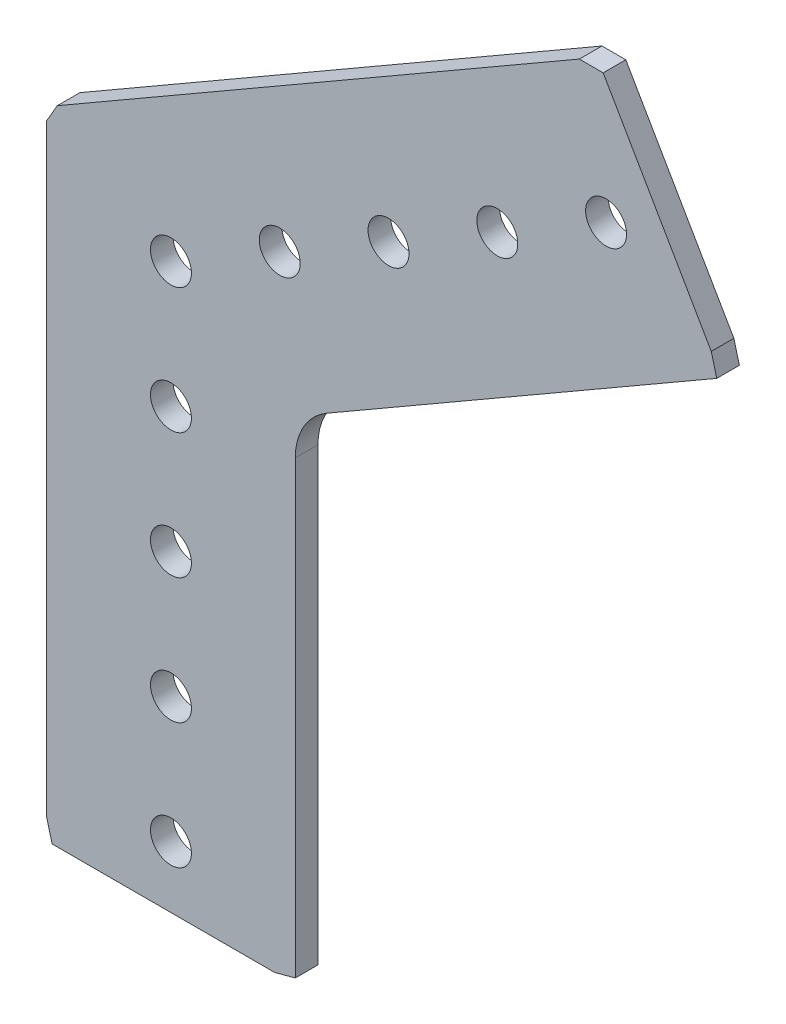
ISO-10303-21;
HEADER;
FILE_DESCRIPTION(('STEP AP214'),'2;1');
FILE_NAME('part.step','',(''),(''),'','','');
FILE_SCHEMA(('AUTOMOTIVE_DESIGN { 1 0 10303 214 1 1 1 1 }'));
ENDSEC;
DATA;
#1=APPLICATION_CONTEXT('core data for automotive mechanical design processes');
#2=APPLICATION_PROTOCOL_DEFINITION('international standard','automotive_design',2000,#1);
#3=PRODUCT_CONTEXT('',#1,'mechanical');
#4=PRODUCT('Part','Part','',(#3));
#5=PRODUCT_RELATED_PRODUCT_CATEGORY('part','',(#4));
#6=PRODUCT_DEFINITION_FORMATION('','',#4);
#7=PRODUCT_DEFINITION_CONTEXT('part definition',#1,'design');
#8=PRODUCT_DEFINITION('design','',#6,#7);
#9=PRODUCT_DEFINITION_SHAPE('','',#8);
#10=(LENGTH_UNIT() NAMED_UNIT(*) SI_UNIT(.MILLI.,.METRE.));
#11=(NAMED_UNIT(*) PLANE_ANGLE_UNIT() SI_UNIT($,.RADIAN.));
#12=(NAMED_UNIT(*) SI_UNIT($,.STERADIAN.) SOLID_ANGLE_UNIT());
#13=UNCERTAINTY_MEASURE_WITH_UNIT(LENGTH_MEASURE(1.E-05),#10,'distance_accuracy_value','');
#14=(GEOMETRIC_REPRESENTATION_CONTEXT(3) GLOBAL_UNCERTAINTY_ASSIGNED_CONTEXT((#13)) GLOBAL_UNIT_ASSIGNED_CONTEXT((#10,
#11,#12)) REPRESENTATION_CONTEXT('',''));
#15=CARTESIAN_POINT('',(0.,0.,0.));
#16=DIRECTION('',(0.,0.,1.));
#17=DIRECTION('',(1.,0.,0.));
#18=AXIS2_PLACEMENT_3D('',#15,#16,#17);
#19=CARTESIAN_POINT('',(0.,0.,2.286));
#20=DIRECTION('',(0.,0.,1.));
#21=DIRECTION('',(1.,0.,0.));
#22=AXIS2_PLACEMENT_3D('',#19,#20,#21);
#23=PLANE('',#22);
#24=DIRECTION('',(0.866025403784435,0.500000000000007,0.));
#25=VECTOR('',#24,1.);
#26=CARTESIAN_POINT('',(43.0968665999997,39.4000374017821,2.286));
#27=LINE('',#26,#25);
#28=CARTESIAN_POINT('',(41.2908279002298,38.357320472303,2.286));
#29=VERTEX_POINT('',#28);
#30=CARTESIAN_POINT('',(-11.4935000000001,7.88227455011127,2.286));
#31=VERTEX_POINT('',#30);
#32=EDGE_CURVE('E547',#29,#31,#27,.F.);
#33=ORIENTED_EDGE('',*,*,#32,.T.);
#34=DIRECTION('',(0.5,0.866025403784439,0.));
#35=VECTOR('',#34,1.);
#36=CARTESIAN_POINT('',(-12.573,6.01252570334088,2.286));
#37=LINE('',#36,#35);
#38=CARTESIAN_POINT('',(-12.573,6.01252570334088,2.286));
#39=VERTEX_POINT('',#38);
#40=EDGE_CURVE('E539',#31,#39,#37,.F.);
#41=ORIENTED_EDGE('',*,*,#40,.T.);
#42=DIRECTION('',(0.,1.,0.));
#43=VECTOR('',#42,1.);
#44=CARTESIAN_POINT('',(-12.573,-57.023,2.286));
#45=LINE('',#44,#43);
#46=CARTESIAN_POINT('',(-12.573,-54.9375661410419,2.286));
#47=VERTEX_POINT('',#46);
#48=EDGE_CURVE('E172',#39,#47,#45,.F.);
#49=ORIENTED_EDGE('',*,*,#48,.T.);
#50=DIRECTION('',(-0.258819045102523,0.965925826289068,0.));
#51=VECTOR('',#50,1.);
#52=CARTESIAN_POINT('',(-12.573,-54.9375661410419,2.286));
#53=LINE('',#52,#51);
#54=CARTESIAN_POINT('',(-12.0142096816237,-57.023,2.286));
#55=VERTEX_POINT('',#54);
#56=EDGE_CURVE('E181',#47,#55,#53,.F.);
#57=ORIENTED_EDGE('',*,*,#56,.T.);
#58=DIRECTION('',(1.,0.,0.));
#59=VECTOR('',#58,1.);
#60=CARTESIAN_POINT('',(12.573,-57.023,2.286));
#61=LINE('',#60,#59);
#62=CARTESIAN_POINT('',(10.4875661410419,-57.023,2.286));
#63=VERTEX_POINT('',#62);
#64=EDGE_CURVE('E161',#55,#63,#61,.T.);
#65=ORIENTED_EDGE('',*,*,#64,.T.);
#66=DIRECTION('',(-0.965925826289068,-0.258819045102521,0.));
#67=VECTOR('',#66,1.);
#68=CARTESIAN_POINT('',(10.4875661410419,-57.023,2.286));
#69=LINE('',#68,#67);
#70=CARTESIAN_POINT('',(12.573,-56.4642096816237,2.286));
#71=VERTEX_POINT('',#70);
#72=EDGE_CURVE('E160',#63,#71,#69,.F.);
#73=ORIENTED_EDGE('',*,*,#72,.T.);
#74=DIRECTION('',(0.,1.,0.));
#75=VECTOR('',#74,1.);
#76=CARTESIAN_POINT('',(12.573,-7.25902493452115,2.286));
#77=LINE('',#76,#75);
#78=CARTESIAN_POINT('',(12.573,-10.9251991438752,2.286));
#79=VERTEX_POINT('',#78);
#80=EDGE_CURVE('E103',#71,#79,#77,.T.);
#81=ORIENTED_EDGE('',*,*,#80,.T.);
#82=CARTESIAN_POINT('',(18.923,-10.9251991438752,2.286));
#83=DIRECTION('',(0.,0.,1.));
#84=DIRECTION('',(1.,0.,0.));
#85=AXIS2_PLACEMENT_3D('',#82,#83,#84);
#86=CIRCLE('',#85,6.35);
#87=CARTESIAN_POINT('',(15.7479999999999,-5.42593782984402,2.286));
#88=VERTEX_POINT('',#87);
#89=EDGE_CURVE('E105',#79,#88,#86,.F.);
#90=ORIENTED_EDGE('',*,*,#89,.T.);
#91=DIRECTION('',(-0.866025403784435,-0.500000000000007,0.));
#92=VECTOR('',#91,1.);
#93=CARTESIAN_POINT('',(12.573,-7.25902493452107,2.286));
#94=LINE('',#93,#92);
#95=CARTESIAN_POINT('',(55.1859399888972,17.3435674390305,2.286));
#96=VERTEX_POINT('',#95);
#97=EDGE_CURVE('E109',#88,#96,#94,.F.);
#98=ORIENTED_EDGE('',*,*,#97,.T.);
#99=DIRECTION('',(0.258819045102525,-0.965925826289067,0.));
#100=VECTOR('',#99,1.);
#101=CARTESIAN_POINT('',(54.6271496705208,19.4290012979886,2.286));
#102=LINE('',#101,#100);
#103=CARTESIAN_POINT('',(54.6271496705208,19.4290012979886,2.286));
#104=VERTEX_POINT('',#103);
#105=EDGE_CURVE('E141',#96,#104,#102,.F.);
#106=ORIENTED_EDGE('',*,*,#105,.T.);
#107=DIRECTION('',(0.500000000000007,-0.866025403784435,0.));
#108=VECTOR('',#107,1.);
#109=CARTESIAN_POINT('',(55.6698665999999,17.6229625982187,2.286));
#110=LINE('',#109,#108);
#111=CARTESIAN_POINT('',(43.6988794999231,38.357320472303,2.286));
#112=VERTEX_POINT('',#111);
#113=EDGE_CURVE('E131',#104,#112,#110,.F.);
#114=ORIENTED_EDGE('',*,*,#113,.T.);
#115=DIRECTION('',(1.,0.,0.));
#116=VECTOR('',#115,1.);
#117=CARTESIAN_POINT('',(41.2908279002298,38.357320472303,2.286));
#118=LINE('',#117,#116);
#119=EDGE_CURVE('E549',#112,#29,#118,.F.);
#120=ORIENTED_EDGE('',*,*,#119,.T.);
#121=EDGE_LOOP('',(#33,#41,#49,#57,#65,#73,#81,#90,#98,#106,#114,#120));
#122=FACE_BOUND('',#121,.T.);
#123=CARTESIAN_POINT('',(0.,0.,2.286));
#124=DIRECTION('',(0.,0.,-1.));
#125=DIRECTION('',(-1.,0.,0.));
#126=AXIS2_PLACEMENT_3D('',#123,#124,#125);
#127=CIRCLE('',#126,2.0701);
#128=CARTESIAN_POINT('',(-2.0701,0.,2.286));
#129=VERTEX_POINT('',#128);
#130=EDGE_CURVE('E178',#129,#129,#127,.T.);
#131=ORIENTED_EDGE('',*,*,#130,.T.);
#132=EDGE_LOOP('',(#131));
#133=FACE_BOUND('',#132,.T.);
#134=CARTESIAN_POINT('',(3.9907631702977E-13,-38.1,2.286));
#135=DIRECTION('',(0.,0.,-1.));
#136=DIRECTION('',(-1.,0.,0.));
#137=AXIS2_PLACEMENT_3D('',#134,#135,#136);
#138=CIRCLE('',#137,2.0701);
#139=CARTESIAN_POINT('',(-2.0700999999996,-38.1,2.286));
#140=VERTEX_POINT('',#139);
#141=EDGE_CURVE('E226',#140,#140,#138,.T.);
#142=ORIENTED_EDGE('',*,*,#141,.T.);
#143=EDGE_LOOP('',(#142));
#144=FACE_BOUND('',#143,.T.);
#145=CARTESIAN_POINT('',(1.33025439009923E-13,-12.7,2.286));
#146=DIRECTION('',(0.,0.,-1.));
#147=DIRECTION('',(-1.,0.,0.));
#148=AXIS2_PLACEMENT_3D('',#145,#146,#147);
#149=CIRCLE('',#148,2.0701);
#150=CARTESIAN_POINT('',(-2.07009999999987,-12.7,2.286));
#151=VERTEX_POINT('',#150);
#152=EDGE_CURVE('E229',#151,#151,#149,.T.);
#153=ORIENTED_EDGE('',*,*,#152,.T.);
#154=EDGE_LOOP('',(#153));
#155=FACE_BOUND('',#154,.T.);
#156=CARTESIAN_POINT('',(2.66050878019847E-13,-25.4,2.286));
#157=DIRECTION('',(0.,0.,-1.));
#158=DIRECTION('',(-1.,0.,0.));
#159=AXIS2_PLACEMENT_3D('',#156,#157,#158);
#160=CIRCLE('',#159,2.0701);
#161=CARTESIAN_POINT('',(-2.07009999999973,-25.4,2.286));
#162=VERTEX_POINT('',#161);
#163=EDGE_CURVE('E232',#162,#162,#160,.T.);
#164=ORIENTED_EDGE('',*,*,#163,.T.);
#165=EDGE_LOOP('',(#164));
#166=FACE_BOUND('',#165,.T.);
#167=CARTESIAN_POINT('',(0.,-50.8,2.286));
#168=DIRECTION('',(0.,0.,-1.));
#169=DIRECTION('',(-1.,0.,0.));
#170=AXIS2_PLACEMENT_3D('',#167,#168,#169);
#171=CIRCLE('',#170,2.0701);
#172=CARTESIAN_POINT('',(-2.07009999999999,-50.8,2.286));
#173=VERTEX_POINT('',#172);
#174=EDGE_CURVE('E235',#173,#173,#171,.T.);
#175=ORIENTED_EDGE('',*,*,#174,.T.);
#176=EDGE_LOOP('',(#175));
#177=FACE_BOUND('',#176,.T.);
#178=CARTESIAN_POINT('',(32.9955678841872,19.0499999999999,2.286));
#179=DIRECTION('',(0.,0.,-1.));
#180=DIRECTION('',(-1.,0.,0.));
#181=AXIS2_PLACEMENT_3D('',#178,#179,#180);
#182=CIRCLE('',#181,2.0701);
#183=CARTESIAN_POINT('',(30.9254678841872,19.0499999999999,2.286));
#184=VERTEX_POINT('',#183);
#185=EDGE_CURVE('E238',#184,#184,#182,.T.);
#186=ORIENTED_EDGE('',*,*,#185,.T.);
#187=EDGE_LOOP('',(#186));
#188=FACE_BOUND('',#187,.T.);
#189=CARTESIAN_POINT('',(10.9985226280624,6.34999999999997,2.286));
#190=DIRECTION('',(0.,0.,-1.));
#191=DIRECTION('',(-1.,0.,0.));
#192=AXIS2_PLACEMENT_3D('',#189,#190,#191);
#193=CIRCLE('',#192,2.0701);
#194=CARTESIAN_POINT('',(8.92842262806239,6.34999999999997,2.286));
#195=VERTEX_POINT('',#194);
#196=EDGE_CURVE('E241',#195,#195,#193,.T.);
#197=ORIENTED_EDGE('',*,*,#196,.T.);
#198=EDGE_LOOP('',(#197));
#199=FACE_BOUND('',#198,.T.);
#200=CARTESIAN_POINT('',(21.9970452561248,12.6999999999999,2.286));
#201=DIRECTION('',(0.,0.,-1.));
#202=DIRECTION('',(-1.,0.,0.));
#203=AXIS2_PLACEMENT_3D('',#200,#201,#202);
#204=CIRCLE('',#203,2.0701);
#205=CARTESIAN_POINT('',(19.9269452561248,12.6999999999999,2.286));
#206=VERTEX_POINT('',#205);
#207=EDGE_CURVE('E243',#206,#206,#204,.T.);
#208=ORIENTED_EDGE('',*,*,#207,.T.);
#209=EDGE_LOOP('',(#208));
#210=FACE_BOUND('',#209,.T.);
#211=CARTESIAN_POINT('',(43.9940905122493,25.4000000000003,2.286));
#212=DIRECTION('',(0.,0.,-1.));
#213=DIRECTION('',(-1.,0.,0.));
#214=AXIS2_PLACEMENT_3D('',#211,#212,#213);
#215=CIRCLE('',#214,2.0701);
#216=CARTESIAN_POINT('',(41.9239905122493,25.4000000000003,2.286));
#217=VERTEX_POINT('',#216);
#218=EDGE_CURVE('E20',#217,#217,#215,.T.);
#219=ORIENTED_EDGE('',*,*,#218,.T.);
#220=EDGE_LOOP('',(#219));
#221=FACE_BOUND('',#220,.T.);
#222=ADVANCED_FACE('F17',(#122,#133,#144,#155,#166,#177,#188,#199,#210,#221),#23,.T.);
#223=CARTESIAN_POINT('',(43.9940905122493,25.4000000000003,2.286));
#224=DIRECTION('',(0.,0.,-1.));
#225=DIRECTION('',(-1.,0.,0.));
#226=AXIS2_PLACEMENT_3D('',#223,#224,#225);
#227=CYLINDRICAL_SURFACE('',#226,2.0701);
#228=ORIENTED_EDGE('',*,*,#218,.F.);
#229=EDGE_LOOP('',(#228));
#230=FACE_BOUND('',#229,.T.);
#231=CARTESIAN_POINT('',(43.9940905122493,25.4000000000003,0.));
#232=DIRECTION('',(0.,0.,-1.));
#233=DIRECTION('',(-1.,0.,0.));
#234=AXIS2_PLACEMENT_3D('',#231,#232,#233);
#235=CIRCLE('',#234,2.0701);
#236=CARTESIAN_POINT('',(41.9239905122493,25.4000000000003,0.));
#237=VERTEX_POINT('',#236);
#238=EDGE_CURVE('E184',#237,#237,#235,.T.);
#239=ORIENTED_EDGE('',*,*,#238,.T.);
#240=EDGE_LOOP('',(#239));
#241=FACE_BOUND('',#240,.T.);
#242=ADVANCED_FACE('F251',(#230,#241),#227,.F.);
#243=CARTESIAN_POINT('',(21.9970452561248,12.6999999999999,2.286));
#244=DIRECTION('',(0.,0.,-1.));
#245=DIRECTION('',(-1.,0.,0.));
#246=AXIS2_PLACEMENT_3D('',#243,#244,#245);
#247=CYLINDRICAL_SURFACE('',#246,2.0701);
#248=ORIENTED_EDGE('',*,*,#207,.F.);
#249=EDGE_LOOP('',(#248));
#250=FACE_BOUND('',#249,.T.);
#251=CARTESIAN_POINT('',(21.9970452561248,12.6999999999999,0.));
#252=DIRECTION('',(0.,0.,-1.));
#253=DIRECTION('',(-1.,0.,0.));
#254=AXIS2_PLACEMENT_3D('',#251,#252,#253);
#255=CIRCLE('',#254,2.0701);
#256=CARTESIAN_POINT('',(19.9269452561248,12.6999999999999,0.));
#257=VERTEX_POINT('',#256);
#258=EDGE_CURVE('E219',#257,#257,#255,.T.);
#259=ORIENTED_EDGE('',*,*,#258,.T.);
#260=EDGE_LOOP('',(#259));
#261=FACE_BOUND('',#260,.T.);
#262=ADVANCED_FACE('F254',(#250,#261),#247,.F.);
#263=CARTESIAN_POINT('',(10.9985226280624,6.34999999999997,2.286));
#264=DIRECTION('',(0.,0.,-1.));
#265=DIRECTION('',(-1.,0.,0.));
#266=AXIS2_PLACEMENT_3D('',#263,#264,#265);
#267=CYLINDRICAL_SURFACE('',#266,2.0701);
#268=ORIENTED_EDGE('',*,*,#196,.F.);
#269=EDGE_LOOP('',(#268));
#270=FACE_BOUND('',#269,.T.);
#271=CARTESIAN_POINT('',(10.9985226280624,6.34999999999997,0.));
#272=DIRECTION('',(0.,0.,-1.));
#273=DIRECTION('',(-1.,0.,0.));
#274=AXIS2_PLACEMENT_3D('',#271,#272,#273);
#275=CIRCLE('',#274,2.0701);
#276=CARTESIAN_POINT('',(8.92842262806239,6.34999999999997,0.));
#277=VERTEX_POINT('',#276);
#278=EDGE_CURVE('E216',#277,#277,#275,.T.);
#279=ORIENTED_EDGE('',*,*,#278,.T.);
#280=EDGE_LOOP('',(#279));
#281=FACE_BOUND('',#280,.T.);
#282=ADVANCED_FACE('F333',(#270,#281),#267,.F.);
#283=CARTESIAN_POINT('',(32.9955678841872,19.0499999999999,2.286));
#284=DIRECTION('',(0.,0.,-1.));
#285=DIRECTION('',(-1.,0.,0.));
#286=AXIS2_PLACEMENT_3D('',#283,#284,#285);
#287=CYLINDRICAL_SURFACE('',#286,2.0701);
#288=ORIENTED_EDGE('',*,*,#185,.F.);
#289=EDGE_LOOP('',(#288));
#290=FACE_BOUND('',#289,.T.);
#291=CARTESIAN_POINT('',(32.9955678841872,19.0499999999999,0.));
#292=DIRECTION('',(0.,0.,-1.));
#293=DIRECTION('',(-1.,0.,0.));
#294=AXIS2_PLACEMENT_3D('',#291,#292,#293);
#295=CIRCLE('',#294,2.0701);
#296=CARTESIAN_POINT('',(30.9254678841872,19.0499999999999,0.));
#297=VERTEX_POINT('',#296);
#298=EDGE_CURVE('E213',#297,#297,#295,.T.);
#299=ORIENTED_EDGE('',*,*,#298,.T.);
#300=EDGE_LOOP('',(#299));
#301=FACE_BOUND('',#300,.T.);
#302=ADVANCED_FACE('F329',(#290,#301),#287,.F.);
#303=CARTESIAN_POINT('',(0.,-50.8,2.286));
#304=DIRECTION('',(0.,0.,-1.));
#305=DIRECTION('',(-1.,0.,0.));
#306=AXIS2_PLACEMENT_3D('',#303,#304,#305);
#307=CYLINDRICAL_SURFACE('',#306,2.0701);
#308=CARTESIAN_POINT('',(0.,-50.8,0.));
#309=DIRECTION('',(0.,0.,-1.));
#310=DIRECTION('',(-1.,0.,0.));
#311=AXIS2_PLACEMENT_3D('',#308,#309,#310);
#312=CIRCLE('',#311,2.0701);
#313=CARTESIAN_POINT('',(-2.07009999999999,-50.8,0.));
#314=VERTEX_POINT('',#313);
#315=EDGE_CURVE('E210',#314,#314,#312,.T.);
#316=ORIENTED_EDGE('',*,*,#315,.T.);
#317=EDGE_LOOP('',(#316));
#318=FACE_BOUND('',#317,.T.);
#319=ORIENTED_EDGE('',*,*,#174,.F.);
#320=EDGE_LOOP('',(#319));
#321=FACE_BOUND('',#320,.T.);
#322=ADVANCED_FACE('F325',(#318,#321),#307,.F.);
#323=CARTESIAN_POINT('',(2.66050878019847E-13,-25.4,2.286));
#324=DIRECTION('',(0.,0.,-1.));
#325=DIRECTION('',(-1.,0.,0.));
#326=AXIS2_PLACEMENT_3D('',#323,#324,#325);
#327=CYLINDRICAL_SURFACE('',#326,2.0701);
#328=CARTESIAN_POINT('',(2.66050878019847E-13,-25.4,0.));
#329=DIRECTION('',(0.,0.,-1.));
#330=DIRECTION('',(-1.,0.,0.));
#331=AXIS2_PLACEMENT_3D('',#328,#329,#330);
#332=CIRCLE('',#331,2.0701);
#333=CARTESIAN_POINT('',(-2.07009999999973,-25.4,0.));
#334=VERTEX_POINT('',#333);
#335=EDGE_CURVE('E207',#334,#334,#332,.T.);
#336=ORIENTED_EDGE('',*,*,#335,.T.);
#337=EDGE_LOOP('',(#336));
#338=FACE_BOUND('',#337,.T.);
#339=ORIENTED_EDGE('',*,*,#163,.F.);
#340=EDGE_LOOP('',(#339));
#341=FACE_BOUND('',#340,.T.);
#342=ADVANCED_FACE('F321',(#338,#341),#327,.F.);
#343=CARTESIAN_POINT('',(1.33025439009923E-13,-12.7,2.286));
#344=DIRECTION('',(0.,0.,-1.));
#345=DIRECTION('',(-1.,0.,0.));
#346=AXIS2_PLACEMENT_3D('',#343,#344,#345);
#347=CYLINDRICAL_SURFACE('',#346,2.0701);
#348=CARTESIAN_POINT('',(1.33025439009923E-13,-12.7,0.));
#349=DIRECTION('',(0.,0.,-1.));
#350=DIRECTION('',(-1.,0.,0.));
#351=AXIS2_PLACEMENT_3D('',#348,#349,#350);
#352=CIRCLE('',#351,2.0701);
#353=CARTESIAN_POINT('',(-2.07009999999987,-12.7,0.));
#354=VERTEX_POINT('',#353);
#355=EDGE_CURVE('E204',#354,#354,#352,.T.);
#356=ORIENTED_EDGE('',*,*,#355,.T.);
#357=EDGE_LOOP('',(#356));
#358=FACE_BOUND('',#357,.T.);
#359=ORIENTED_EDGE('',*,*,#152,.F.);
#360=EDGE_LOOP('',(#359));
#361=FACE_BOUND('',#360,.T.);
#362=ADVANCED_FACE('F317',(#358,#361),#347,.F.);
#363=CARTESIAN_POINT('',(3.9907631702977E-13,-38.1,2.286));
#364=DIRECTION('',(0.,0.,-1.));
#365=DIRECTION('',(-1.,0.,0.));
#366=AXIS2_PLACEMENT_3D('',#363,#364,#365);
#367=CYLINDRICAL_SURFACE('',#366,2.0701);
#368=CARTESIAN_POINT('',(3.9907631702977E-13,-38.1,0.));
#369=DIRECTION('',(0.,0.,-1.));
#370=DIRECTION('',(-1.,0.,0.));
#371=AXIS2_PLACEMENT_3D('',#368,#369,#370);
#372=CIRCLE('',#371,2.0701);
#373=CARTESIAN_POINT('',(-2.0700999999996,-38.1,0.));
#374=VERTEX_POINT('',#373);
#375=EDGE_CURVE('E201',#374,#374,#372,.T.);
#376=ORIENTED_EDGE('',*,*,#375,.T.);
#377=EDGE_LOOP('',(#376));
#378=FACE_BOUND('',#377,.T.);
#379=ORIENTED_EDGE('',*,*,#141,.F.);
#380=EDGE_LOOP('',(#379));
#381=FACE_BOUND('',#380,.T.);
#382=ADVANCED_FACE('F313',(#378,#381),#367,.F.);
#383=CARTESIAN_POINT('',(0.,0.,2.286));
#384=DIRECTION('',(0.,0.,-1.));
#385=DIRECTION('',(-1.,0.,0.));
#386=AXIS2_PLACEMENT_3D('',#383,#384,#385);
#387=CYLINDRICAL_SURFACE('',#386,2.0701);
#388=ORIENTED_EDGE('',*,*,#130,.F.);
#389=EDGE_LOOP('',(#388));
#390=FACE_BOUND('',#389,.T.);
#391=CARTESIAN_POINT('',(0.,0.,0.));
#392=DIRECTION('',(0.,0.,-1.));
#393=DIRECTION('',(-1.,0.,0.));
#394=AXIS2_PLACEMENT_3D('',#391,#392,#393);
#395=CIRCLE('',#394,2.0701);
#396=CARTESIAN_POINT('',(-2.0701,0.,0.));
#397=VERTEX_POINT('',#396);
#398=EDGE_CURVE('E166',#397,#397,#395,.T.);
#399=ORIENTED_EDGE('',*,*,#398,.T.);
#400=EDGE_LOOP('',(#399));
#401=FACE_BOUND('',#400,.T.);
#402=ADVANCED_FACE('F309',(#390,#401),#387,.F.);
#403=CARTESIAN_POINT('',(12.573,-57.023,2.286));
#404=DIRECTION('',(0.,1.,0.));
#405=DIRECTION('',(0.,0.,1.));
#406=AXIS2_PLACEMENT_3D('',#403,#404,#405);
#407=PLANE('',#406);
#408=DIRECTION('',(1.,0.,0.));
#409=VECTOR('',#408,1.);
#410=CARTESIAN_POINT('',(0.,-57.023,0.));
#411=LINE('',#410,#409);
#412=CARTESIAN_POINT('',(-12.0142096816237,-57.023,0.));
#413=VERTEX_POINT('',#412);
#414=CARTESIAN_POINT('',(10.4875661410419,-57.023,0.));
#415=VERTEX_POINT('',#414);
#416=EDGE_CURVE('E154',#413,#415,#411,.T.);
#417=ORIENTED_EDGE('',*,*,#416,.T.);
#418=DIRECTION('',(0.,0.,1.));
#419=VECTOR('',#418,1.);
#420=CARTESIAN_POINT('',(10.4875661410419,-57.023,2.286));
#421=LINE('',#420,#419);
#422=EDGE_CURVE('E157',#415,#63,#421,.T.);
#423=ORIENTED_EDGE('',*,*,#422,.T.);
#424=ORIENTED_EDGE('',*,*,#64,.F.);
#425=DIRECTION('',(0.,0.,1.));
#426=VECTOR('',#425,1.);
#427=CARTESIAN_POINT('',(-12.0142096816237,-57.023,2.286));
#428=LINE('',#427,#426);
#429=EDGE_CURVE('E169',#55,#413,#428,.F.);
#430=ORIENTED_EDGE('',*,*,#429,.T.);
#431=EDGE_LOOP('',(#417,#423,#424,#430));
#432=FACE_BOUND('',#431,.T.);
#433=ADVANCED_FACE('F305',(#432),#407,.F.);
#434=CARTESIAN_POINT('',(10.4875661410419,-57.023,2.286));
#435=DIRECTION('',(-0.258819045102521,0.965925826289068,0.));
#436=DIRECTION('',(-0.965925826289068,-0.258819045102521,0.));
#437=AXIS2_PLACEMENT_3D('',#434,#435,#436);
#438=PLANE('',#437);
#439=ORIENTED_EDGE('',*,*,#422,.F.);
#440=DIRECTION('',(0.965925826289067,0.258819045102524,0.));
#441=VECTOR('',#440,1.);
#442=CARTESIAN_POINT('',(10.4875661410419,-57.023,0.));
#443=LINE('',#442,#441);
#444=CARTESIAN_POINT('',(12.573,-56.4642096816237,0.));
#445=VERTEX_POINT('',#444);
#446=EDGE_CURVE('E150',#415,#445,#443,.T.);
#447=ORIENTED_EDGE('',*,*,#446,.T.);
#448=DIRECTION('',(0.,0.,1.));
#449=VECTOR('',#448,1.);
#450=CARTESIAN_POINT('',(12.573,-56.4642096816237,2.286));
#451=LINE('',#450,#449);
#452=EDGE_CURVE('E145',#445,#71,#451,.T.);
#453=ORIENTED_EDGE('',*,*,#452,.T.);
#454=ORIENTED_EDGE('',*,*,#72,.F.);
#455=EDGE_LOOP('',(#439,#447,#453,#454));
#456=FACE_BOUND('',#455,.T.);
#457=ADVANCED_FACE('F301',(#456),#438,.F.);
#458=CARTESIAN_POINT('',(12.573,-7.25902493452115,2.286));
#459=DIRECTION('',(-1.,0.,0.));
#460=DIRECTION('',(0.,0.,1.));
#461=AXIS2_PLACEMENT_3D('',#458,#459,#460);
#462=PLANE('',#461);
#463=DIRECTION('',(0.,1.,0.));
#464=VECTOR('',#463,1.);
#465=CARTESIAN_POINT('',(12.573,0.,0.));
#466=LINE('',#465,#464);
#467=CARTESIAN_POINT('',(12.573,-10.9251991438752,0.));
#468=VERTEX_POINT('',#467);
#469=EDGE_CURVE('E153',#445,#468,#466,.T.);
#470=ORIENTED_EDGE('',*,*,#469,.T.);
#471=DIRECTION('',(0.,0.,1.));
#472=VECTOR('',#471,1.);
#473=CARTESIAN_POINT('',(12.573,-10.9251991438752,2.286));
#474=LINE('',#473,#472);
#475=EDGE_CURVE('E115',#468,#79,#474,.T.);
#476=ORIENTED_EDGE('',*,*,#475,.T.);
#477=ORIENTED_EDGE('',*,*,#80,.F.);
#478=ORIENTED_EDGE('',*,*,#452,.F.);
#479=EDGE_LOOP('',(#470,#476,#477,#478));
#480=FACE_BOUND('',#479,.T.);
#481=ADVANCED_FACE('F298',(#480),#462,.F.);
#482=CARTESIAN_POINT('',(18.923,-10.9251991438752,2.286));
#483=DIRECTION('',(0.,0.,1.));
#484=DIRECTION('',(1.,0.,0.));
#485=AXIS2_PLACEMENT_3D('',#482,#483,#484);
#486=CYLINDRICAL_SURFACE('',#485,6.35);
#487=ORIENTED_EDGE('',*,*,#475,.F.);
#488=CARTESIAN_POINT('',(18.923,-10.9251991438752,0.));
#489=DIRECTION('',(0.,0.,1.));
#490=DIRECTION('',(1.,0.,0.));
#491=AXIS2_PLACEMENT_3D('',#488,#489,#490);
#492=CIRCLE('',#491,6.35);
#493=CARTESIAN_POINT('',(15.7479999999999,-5.42593782984402,0.));
#494=VERTEX_POINT('',#493);
#495=EDGE_CURVE('E127',#468,#494,#492,.F.);
#496=ORIENTED_EDGE('',*,*,#495,.T.);
#497=DIRECTION('',(0.,0.,1.));
#498=VECTOR('',#497,1.);
#499=CARTESIAN_POINT('',(15.7479999999999,-5.42593782984402,2.286));
#500=LINE('',#499,#498);
#501=EDGE_CURVE('E114',#494,#88,#500,.T.);
#502=ORIENTED_EDGE('',*,*,#501,.T.);
#503=ORIENTED_EDGE('',*,*,#89,.F.);
#504=EDGE_LOOP('',(#487,#496,#502,#503));
#505=FACE_BOUND('',#504,.T.);
#506=ADVANCED_FACE('F125',(#505),#486,.F.);
#507=CARTESIAN_POINT('',(12.573,-7.25902493452107,2.286));
#508=DIRECTION('',(-0.500000000000007,0.866025403784435,0.));
#509=DIRECTION('',(-0.866025403784435,-0.500000000000007,0.));
#510=AXIS2_PLACEMENT_3D('',#507,#508,#509);
#511=PLANE('',#510);
#512=ORIENTED_EDGE('',*,*,#97,.F.);
#513=ORIENTED_EDGE('',*,*,#501,.F.);
#514=DIRECTION('',(0.866025403784435,0.500000000000007,0.));
#515=VECTOR('',#514,1.);
#516=CARTESIAN_POINT('',(15.7479999999999,-5.42593782984402,0.));
#517=LINE('',#516,#515);
#518=CARTESIAN_POINT('',(55.1859399888972,17.3435674390305,0.));
#519=VERTEX_POINT('',#518);
#520=EDGE_CURVE('E137',#494,#519,#517,.T.);
#521=ORIENTED_EDGE('',*,*,#520,.T.);
#522=DIRECTION('',(0.,0.,1.));
#523=VECTOR('',#522,1.);
#524=CARTESIAN_POINT('',(55.1859399888972,17.3435674390305,2.286));
#525=LINE('',#524,#523);
#526=EDGE_CURVE('E122',#519,#96,#525,.T.);
#527=ORIENTED_EDGE('',*,*,#526,.T.);
#528=EDGE_LOOP('',(#512,#513,#521,#527));
#529=FACE_BOUND('',#528,.T.);
#530=ADVANCED_FACE('F119',(#529),#511,.F.);
#531=CARTESIAN_POINT('',(54.6271496705208,19.4290012979886,2.286));
#532=DIRECTION('',(-0.965925826289067,-0.258819045102525,0.));
#533=DIRECTION('',(0.258819045102525,-0.965925826289067,0.));
#534=AXIS2_PLACEMENT_3D('',#531,#532,#533);
#535=PLANE('',#534);
#536=ORIENTED_EDGE('',*,*,#526,.F.);
#537=DIRECTION('',(-0.258819045102545,0.965925826289062,0.));
#538=VECTOR('',#537,1.);
#539=CARTESIAN_POINT('',(55.1859399888972,17.3435674390305,0.));
#540=LINE('',#539,#538);
#541=CARTESIAN_POINT('',(54.6271496705208,19.4290012979886,0.));
#542=VERTEX_POINT('',#541);
#543=EDGE_CURVE('E133',#519,#542,#540,.T.);
#544=ORIENTED_EDGE('',*,*,#543,.T.);
#545=DIRECTION('',(0.,0.,1.));
#546=VECTOR('',#545,1.);
#547=CARTESIAN_POINT('',(54.6271496705208,19.4290012979886,2.286));
#548=LINE('',#547,#546);
#549=EDGE_CURVE('E554',#542,#104,#548,.T.);
#550=ORIENTED_EDGE('',*,*,#549,.T.);
#551=ORIENTED_EDGE('',*,*,#105,.F.);
#552=EDGE_LOOP('',(#536,#544,#550,#551));
#553=FACE_BOUND('',#552,.T.);
#554=ADVANCED_FACE('F289',(#553),#535,.F.);
#555=CARTESIAN_POINT('',(55.6698665999999,17.6229625982187,2.286));
#556=DIRECTION('',(-0.866025403784435,-0.500000000000007,0.));
#557=DIRECTION('',(0.500000000000007,-0.866025403784435,0.));
#558=AXIS2_PLACEMENT_3D('',#555,#556,#557);
#559=PLANE('',#558);
#560=DIRECTION('',(-0.500000000000007,0.866025403784435,0.));
#561=VECTOR('',#560,1.);
#562=CARTESIAN_POINT('',(54.6271496705208,19.4290012979886,0.));
#563=LINE('',#562,#561);
#564=CARTESIAN_POINT('',(43.6988794999231,38.357320472303,0.));
#565=VERTEX_POINT('',#564);
#566=EDGE_CURVE('E136',#542,#565,#563,.T.);
#567=ORIENTED_EDGE('',*,*,#566,.T.);
#568=DIRECTION('',(0.,0.,-1.));
#569=VECTOR('',#568,1.);
#570=CARTESIAN_POINT('',(43.6988794999231,38.357320472303,2.286));
#571=LINE('',#570,#569);
#572=EDGE_CURVE('E552',#565,#112,#571,.F.);
#573=ORIENTED_EDGE('',*,*,#572,.T.);
#574=ORIENTED_EDGE('',*,*,#113,.F.);
#575=ORIENTED_EDGE('',*,*,#549,.F.);
#576=EDGE_LOOP('',(#567,#573,#574,#575));
#577=FACE_BOUND('',#576,.T.);
#578=ADVANCED_FACE('F285',(#577),#559,.F.);
#579=CARTESIAN_POINT('',(41.2908279002298,38.357320472303,2.286));
#580=DIRECTION('',(0.,-1.,0.));
#581=DIRECTION('',(0.,0.,-1.));
#582=AXIS2_PLACEMENT_3D('',#579,#580,#581);
#583=PLANE('',#582);
#584=ORIENTED_EDGE('',*,*,#572,.F.);
#585=DIRECTION('',(1.,0.,0.));
#586=VECTOR('',#585,1.);
#587=CARTESIAN_POINT('',(0.,38.357320472303,0.));
#588=LINE('',#587,#586);
#589=CARTESIAN_POINT('',(41.2908279002298,38.357320472303,0.));
#590=VERTEX_POINT('',#589);
#591=EDGE_CURVE('E562',#565,#590,#588,.F.);
#592=ORIENTED_EDGE('',*,*,#591,.T.);
#593=DIRECTION('',(0.,0.,1.));
#594=VECTOR('',#593,1.);
#595=CARTESIAN_POINT('',(41.2908279002298,38.357320472303,2.286));
#596=LINE('',#595,#594);
#597=EDGE_CURVE('E544',#590,#29,#596,.T.);
#598=ORIENTED_EDGE('',*,*,#597,.T.);
#599=ORIENTED_EDGE('',*,*,#119,.F.);
#600=EDGE_LOOP('',(#584,#592,#598,#599));
#601=FACE_BOUND('',#600,.T.);
#602=ADVANCED_FACE('F281',(#601),#583,.F.);
#603=CARTESIAN_POINT('',(43.0968665999997,39.4000374017821,2.286));
#604=DIRECTION('',(0.500000000000007,-0.866025403784435,0.));
#605=DIRECTION('',(0.866025403784435,0.500000000000007,0.));
#606=AXIS2_PLACEMENT_3D('',#603,#604,#605);
#607=PLANE('',#606);
#608=DIRECTION('',(-0.866025403784435,-0.500000000000007,0.));
#609=VECTOR('',#608,1.);
#610=CARTESIAN_POINT('',(41.2908279002298,38.357320472303,0.));
#611=LINE('',#610,#609);
#612=CARTESIAN_POINT('',(-11.4935000000001,7.88227455011129,0.));
#613=VERTEX_POINT('',#612);
#614=EDGE_CURVE('E564',#590,#613,#611,.T.);
#615=ORIENTED_EDGE('',*,*,#614,.T.);
#616=DIRECTION('',(0.,0.,1.));
#617=VECTOR('',#616,1.);
#618=CARTESIAN_POINT('',(-11.4935000000001,7.88227455011136,2.286));
#619=LINE('',#618,#617);
#620=EDGE_CURVE('E541',#613,#31,#619,.T.);
#621=ORIENTED_EDGE('',*,*,#620,.T.);
#622=ORIENTED_EDGE('',*,*,#32,.F.);
#623=ORIENTED_EDGE('',*,*,#597,.F.);
#624=EDGE_LOOP('',(#615,#621,#622,#623));
#625=FACE_BOUND('',#624,.T.);
#626=ADVANCED_FACE('F277',(#625),#607,.F.);
#627=CARTESIAN_POINT('',(-12.573,6.01252570334088,2.286));
#628=DIRECTION('',(0.866025403784439,-0.5,0.));
#629=DIRECTION('',(0.5,0.866025403784439,0.));
#630=AXIS2_PLACEMENT_3D('',#627,#628,#629);
#631=PLANE('',#630);
#632=ORIENTED_EDGE('',*,*,#620,.F.);
#633=DIRECTION('',(-0.500000000000038,-0.866025403784417,0.));
#634=VECTOR('',#633,1.);
#635=CARTESIAN_POINT('',(-11.4935,7.88227455011131,0.));
#636=LINE('',#635,#634);
#637=CARTESIAN_POINT('',(-12.573,6.01252570334088,0.));
#638=VERTEX_POINT('',#637);
#639=EDGE_CURVE('E572',#613,#638,#636,.T.);
#640=ORIENTED_EDGE('',*,*,#639,.T.);
#641=DIRECTION('',(0.,0.,-1.));
#642=VECTOR('',#641,1.);
#643=CARTESIAN_POINT('',(-12.573,6.01252570334088,2.286));
#644=LINE('',#643,#642);
#645=EDGE_CURVE('E537',#638,#39,#644,.F.);
#646=ORIENTED_EDGE('',*,*,#645,.T.);
#647=ORIENTED_EDGE('',*,*,#40,.F.);
#648=EDGE_LOOP('',(#632,#640,#646,#647));
#649=FACE_BOUND('',#648,.T.);
#650=ADVANCED_FACE('F273',(#649),#631,.F.);
#651=CARTESIAN_POINT('',(-12.573,-57.023,2.286));
#652=DIRECTION('',(1.,0.,0.));
#653=DIRECTION('',(0.,0.,-1.));
#654=AXIS2_PLACEMENT_3D('',#651,#652,#653);
#655=PLANE('',#654);
#656=ORIENTED_EDGE('',*,*,#48,.F.);
#657=ORIENTED_EDGE('',*,*,#645,.F.);
#658=DIRECTION('',(0.,1.,0.));
#659=VECTOR('',#658,1.);
#660=CARTESIAN_POINT('',(-12.573,0.,0.));
#661=LINE('',#660,#659);
#662=CARTESIAN_POINT('',(-12.573,-54.9375661410419,0.));
#663=VERTEX_POINT('',#662);
#664=EDGE_CURVE('E26',#638,#663,#661,.F.);
#665=ORIENTED_EDGE('',*,*,#664,.T.);
#666=DIRECTION('',(0.,0.,1.));
#667=VECTOR('',#666,1.);
#668=CARTESIAN_POINT('',(-12.573,-54.9375661410419,2.286));
#669=LINE('',#668,#667);
#670=EDGE_CURVE('E34',#663,#47,#669,.T.);
#671=ORIENTED_EDGE('',*,*,#670,.T.);
#672=EDGE_LOOP('',(#656,#657,#665,#671));
#673=FACE_BOUND('',#672,.T.);
#674=ADVANCED_FACE('F266',(#673),#655,.F.);
#675=CARTESIAN_POINT('',(-12.573,-54.9375661410419,2.286));
#676=DIRECTION('',(0.965925826289068,0.258819045102523,0.));
#677=DIRECTION('',(-0.258819045102523,0.965925826289068,0.));
#678=AXIS2_PLACEMENT_3D('',#675,#676,#677);
#679=PLANE('',#678);
#680=ORIENTED_EDGE('',*,*,#670,.F.);
#681=DIRECTION('',(0.258819045102523,-0.965925826289068,0.));
#682=VECTOR('',#681,1.);
#683=CARTESIAN_POINT('',(-12.573,-54.9375661410419,0.));
#684=LINE('',#683,#682);
#685=EDGE_CURVE('E10',#663,#413,#684,.T.);
#686=ORIENTED_EDGE('',*,*,#685,.T.);
#687=ORIENTED_EDGE('',*,*,#429,.F.);
#688=ORIENTED_EDGE('',*,*,#56,.F.);
#689=EDGE_LOOP('',(#680,#686,#687,#688));
#690=FACE_BOUND('',#689,.T.);
#691=ADVANCED_FACE('F259',(#690),#679,.F.);
#692=CARTESIAN_POINT('',(0.,0.,0.));
#693=DIRECTION('',(0.,0.,1.));
#694=DIRECTION('',(1.,0.,0.));
#695=AXIS2_PLACEMENT_3D('',#692,#693,#694);
#696=PLANE('',#695);
#697=ORIENTED_EDGE('',*,*,#664,.F.);
#698=ORIENTED_EDGE('',*,*,#639,.F.);
#699=ORIENTED_EDGE('',*,*,#614,.F.);
#700=ORIENTED_EDGE('',*,*,#591,.F.);
#701=ORIENTED_EDGE('',*,*,#566,.F.);
#702=ORIENTED_EDGE('',*,*,#543,.F.);
#703=ORIENTED_EDGE('',*,*,#520,.F.);
#704=ORIENTED_EDGE('',*,*,#495,.F.);
#705=ORIENTED_EDGE('',*,*,#469,.F.);
#706=ORIENTED_EDGE('',*,*,#446,.F.);
#707=ORIENTED_EDGE('',*,*,#416,.F.);
#708=ORIENTED_EDGE('',*,*,#685,.F.);
#709=EDGE_LOOP('',(#697,#698,#699,#700,#701,#702,#703,#704,#705,#706,#707,#708));
#710=FACE_BOUND('',#709,.T.);
#711=ORIENTED_EDGE('',*,*,#398,.F.);
#712=EDGE_LOOP('',(#711));
#713=FACE_BOUND('',#712,.T.);
#714=ORIENTED_EDGE('',*,*,#375,.F.);
#715=EDGE_LOOP('',(#714));
#716=FACE_BOUND('',#715,.T.);
#717=ORIENTED_EDGE('',*,*,#355,.F.);
#718=EDGE_LOOP('',(#717));
#719=FACE_BOUND('',#718,.T.);
#720=ORIENTED_EDGE('',*,*,#335,.F.);
#721=EDGE_LOOP('',(#720));
#722=FACE_BOUND('',#721,.T.);
#723=ORIENTED_EDGE('',*,*,#315,.F.);
#724=EDGE_LOOP('',(#723));
#725=FACE_BOUND('',#724,.T.);
#726=ORIENTED_EDGE('',*,*,#298,.F.);
#727=EDGE_LOOP('',(#726));
#728=FACE_BOUND('',#727,.T.);
#729=ORIENTED_EDGE('',*,*,#278,.F.);
#730=EDGE_LOOP('',(#729));
#731=FACE_BOUND('',#730,.T.);
#732=ORIENTED_EDGE('',*,*,#258,.F.);
#733=EDGE_LOOP('',(#732));
#734=FACE_BOUND('',#733,.T.);
#735=ORIENTED_EDGE('',*,*,#238,.F.);
#736=EDGE_LOOP('',(#735));
#737=FACE_BOUND('',#736,.T.);
#738=ADVANCED_FACE('F257',(#710,#713,#716,#719,#722,#725,#728,#731,#734,#737),#696,.F.);
#739=CLOSED_SHELL('',(#222,#242,#262,#282,#302,#322,#342,#362,#382,#402,#433,#457,#481,#506,
#530,#554,#578,#602,#626,#650,#674,#691,#738));
#740=MANIFOLD_SOLID_BREP('B1',#739);
#741=ADVANCED_BREP_SHAPE_REPRESENTATION('',(#18,#740),#14);
#742=SHAPE_DEFINITION_REPRESENTATION(#9,#741);
ENDSEC;
END-ISO-10303-21;
